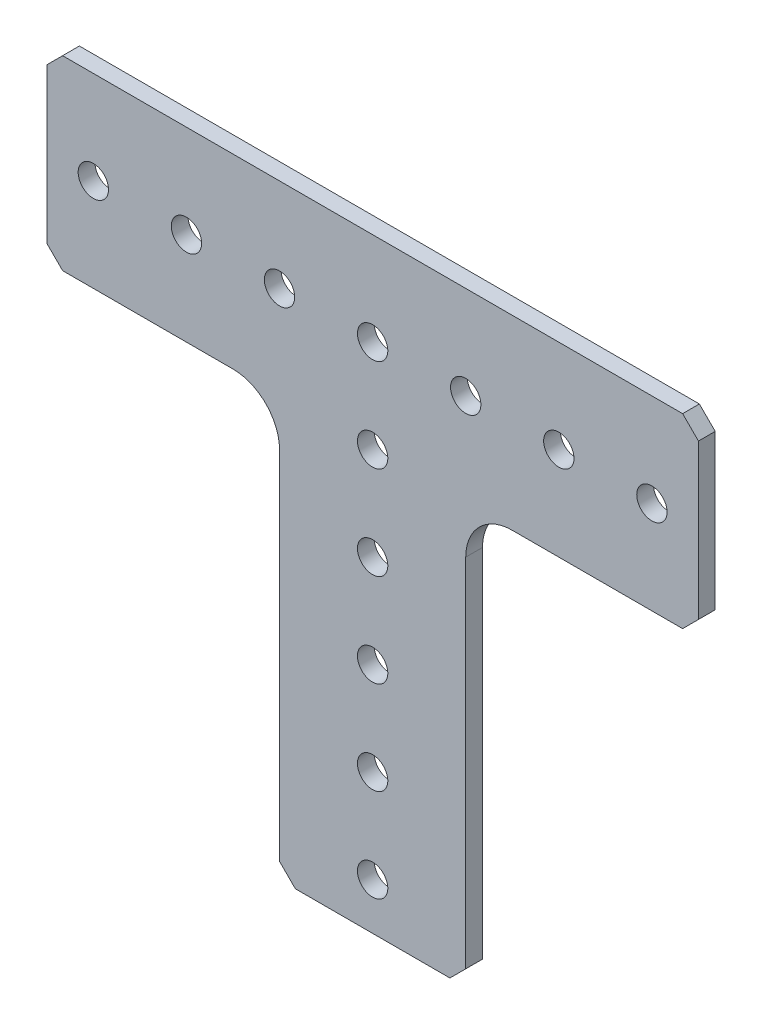
ISO-10303-21;
HEADER;
FILE_DESCRIPTION(('STEP AP214'),'2;1');
FILE_NAME('part.step','',(''),(''),'','','');
FILE_SCHEMA(('AUTOMOTIVE_DESIGN { 1 0 10303 214 1 1 1 1 }'));
ENDSEC;
DATA;
#1=APPLICATION_CONTEXT('core data for automotive mechanical design processes');
#2=APPLICATION_PROTOCOL_DEFINITION('international standard','automotive_design',2000,#1);
#3=PRODUCT_CONTEXT('',#1,'mechanical');
#4=PRODUCT('Part','Part','',(#3));
#5=PRODUCT_RELATED_PRODUCT_CATEGORY('part','',(#4));
#6=PRODUCT_DEFINITION_FORMATION('','',#4);
#7=PRODUCT_DEFINITION_CONTEXT('part definition',#1,'design');
#8=PRODUCT_DEFINITION('design','',#6,#7);
#9=PRODUCT_DEFINITION_SHAPE('','',#8);
#10=(LENGTH_UNIT() NAMED_UNIT(*) SI_UNIT(.MILLI.,.METRE.));
#11=(NAMED_UNIT(*) PLANE_ANGLE_UNIT() SI_UNIT($,.RADIAN.));
#12=(NAMED_UNIT(*) SI_UNIT($,.STERADIAN.) SOLID_ANGLE_UNIT());
#13=UNCERTAINTY_MEASURE_WITH_UNIT(LENGTH_MEASURE(1.E-05),#10,'distance_accuracy_value','');
#14=(GEOMETRIC_REPRESENTATION_CONTEXT(3) GLOBAL_UNCERTAINTY_ASSIGNED_CONTEXT((#13)) GLOBAL_UNIT_ASSIGNED_CONTEXT((#10,
#11,#12)) REPRESENTATION_CONTEXT('',''));
#15=CARTESIAN_POINT('',(0.,0.,0.));
#16=DIRECTION('',(0.,0.,1.));
#17=DIRECTION('',(1.,0.,0.));
#18=AXIS2_PLACEMENT_3D('',#15,#16,#17);
#19=CARTESIAN_POINT('',(10.541,-57.15,0.));
#20=DIRECTION('',(0.707106781186548,-0.707106781186547,0.));
#21=DIRECTION('',(0.707106781186547,0.707106781186548,0.));
#22=AXIS2_PLACEMENT_3D('',#19,#20,#21);
#23=PLANE('',#22);
#24=DIRECTION('',(0.707106781186547,0.707106781186548,0.));
#25=VECTOR('',#24,1.);
#26=CARTESIAN_POINT('',(10.541,-57.15,2.286));
#27=LINE('',#26,#25);
#28=CARTESIAN_POINT('',(10.541,-57.15,2.286));
#29=VERTEX_POINT('',#28);
#30=CARTESIAN_POINT('',(12.7,-54.991,2.286));
#31=VERTEX_POINT('',#30);
#32=EDGE_CURVE('E203',#29,#31,#27,.T.);
#33=ORIENTED_EDGE('',*,*,#32,.F.);
#34=DIRECTION('',(0.,0.,1.));
#35=VECTOR('',#34,1.);
#36=CARTESIAN_POINT('',(10.541,-57.15,0.));
#37=LINE('',#36,#35);
#38=CARTESIAN_POINT('',(10.541,-57.15,0.));
#39=VERTEX_POINT('',#38);
#40=EDGE_CURVE('E11',#39,#29,#37,.T.);
#41=ORIENTED_EDGE('',*,*,#40,.F.);
#42=DIRECTION('',(0.707106781186547,0.707106781186548,0.));
#43=VECTOR('',#42,1.);
#44=CARTESIAN_POINT('',(10.541,-57.15,0.));
#45=LINE('',#44,#43);
#46=CARTESIAN_POINT('',(12.7,-54.991,0.));
#47=VERTEX_POINT('',#46);
#48=EDGE_CURVE('E258',#39,#47,#45,.T.);
#49=ORIENTED_EDGE('',*,*,#48,.T.);
#50=DIRECTION('',(0.,0.,1.));
#51=VECTOR('',#50,1.);
#52=CARTESIAN_POINT('',(12.7,-54.991,0.));
#53=LINE('',#52,#51);
#54=EDGE_CURVE('E44',#47,#31,#53,.T.);
#55=ORIENTED_EDGE('',*,*,#54,.T.);
#56=EDGE_LOOP('',(#33,#41,#49,#55));
#57=FACE_BOUND('',#56,.T.);
#58=ADVANCED_FACE('F41',(#57),#23,.T.);
#59=CARTESIAN_POINT('',(-10.541,-57.15,0.));
#60=DIRECTION('',(0.,-1.,0.));
#61=DIRECTION('',(0.,0.,-1.));
#62=AXIS2_PLACEMENT_3D('',#59,#60,#61);
#63=PLANE('',#62);
#64=DIRECTION('',(1.,0.,0.));
#65=VECTOR('',#64,1.);
#66=CARTESIAN_POINT('',(-10.541,-57.15,2.286));
#67=LINE('',#66,#65);
#68=CARTESIAN_POINT('',(-10.541,-57.15,2.286));
#69=VERTEX_POINT('',#68);
#70=EDGE_CURVE('E255',#69,#29,#67,.T.);
#71=ORIENTED_EDGE('',*,*,#70,.F.);
#72=DIRECTION('',(0.,0.,1.));
#73=VECTOR('',#72,1.);
#74=CARTESIAN_POINT('',(-10.541,-57.15,0.));
#75=LINE('',#74,#73);
#76=CARTESIAN_POINT('',(-10.541,-57.15,0.));
#77=VERTEX_POINT('',#76);
#78=EDGE_CURVE('E51',#77,#69,#75,.T.);
#79=ORIENTED_EDGE('',*,*,#78,.F.);
#80=DIRECTION('',(1.,0.,0.));
#81=VECTOR('',#80,1.);
#82=CARTESIAN_POINT('',(-10.541,-57.15,0.));
#83=LINE('',#82,#81);
#84=EDGE_CURVE('E191',#77,#39,#83,.T.);
#85=ORIENTED_EDGE('',*,*,#84,.T.);
#86=ORIENTED_EDGE('',*,*,#40,.T.);
#87=EDGE_LOOP('',(#71,#79,#85,#86));
#88=FACE_BOUND('',#87,.T.);
#89=ADVANCED_FACE('F292',(#88),#63,.T.);
#90=CARTESIAN_POINT('',(-12.7,-54.991,0.));
#91=DIRECTION('',(-0.707106781186548,-0.707106781186547,0.));
#92=DIRECTION('',(0.707106781186547,-0.707106781186548,0.));
#93=AXIS2_PLACEMENT_3D('',#90,#91,#92);
#94=PLANE('',#93);
#95=DIRECTION('',(0.707106781186547,-0.707106781186548,0.));
#96=VECTOR('',#95,1.);
#97=CARTESIAN_POINT('',(-12.7,-54.991,2.286));
#98=LINE('',#97,#96);
#99=CARTESIAN_POINT('',(-12.7,-54.991,2.286));
#100=VERTEX_POINT('',#99);
#101=EDGE_CURVE('E178',#100,#69,#98,.T.);
#102=ORIENTED_EDGE('',*,*,#101,.F.);
#103=DIRECTION('',(0.,0.,1.));
#104=VECTOR('',#103,1.);
#105=CARTESIAN_POINT('',(-12.7,-54.991,0.));
#106=LINE('',#105,#104);
#107=CARTESIAN_POINT('',(-12.7,-54.991,0.));
#108=VERTEX_POINT('',#107);
#109=EDGE_CURVE('E173',#108,#100,#106,.T.);
#110=ORIENTED_EDGE('',*,*,#109,.F.);
#111=DIRECTION('',(0.707106781186547,-0.707106781186548,0.));
#112=VECTOR('',#111,1.);
#113=CARTESIAN_POINT('',(-12.7,-54.991,0.));
#114=LINE('',#113,#112);
#115=EDGE_CURVE('E176',#108,#77,#114,.T.);
#116=ORIENTED_EDGE('',*,*,#115,.T.);
#117=ORIENTED_EDGE('',*,*,#78,.T.);
#118=EDGE_LOOP('',(#102,#110,#116,#117));
#119=FACE_BOUND('',#118,.T.);
#120=ADVANCED_FACE('F175',(#119),#94,.T.);
#121=CARTESIAN_POINT('',(-12.7,-6.34999999999998,0.));
#122=DIRECTION('',(-1.,0.,0.));
#123=DIRECTION('',(0.,-1.,0.));
#124=AXIS2_PLACEMENT_3D('',#121,#122,#123);
#125=PLANE('',#124);
#126=DIRECTION('',(0.,-1.,0.));
#127=VECTOR('',#126,1.);
#128=CARTESIAN_POINT('',(-12.7,-6.34999999999998,2.286));
#129=LINE('',#128,#127);
#130=CARTESIAN_POINT('',(-12.7,-6.34999999999999,2.286));
#131=VERTEX_POINT('',#130);
#132=EDGE_CURVE('E252',#131,#100,#129,.T.);
#133=ORIENTED_EDGE('',*,*,#132,.F.);
#134=DIRECTION('',(0.,0.,1.));
#135=VECTOR('',#134,1.);
#136=CARTESIAN_POINT('',(-12.7,-6.34999999999999,0.));
#137=LINE('',#136,#135);
#138=CARTESIAN_POINT('',(-12.7,-6.34999999999999,0.));
#139=VERTEX_POINT('',#138);
#140=EDGE_CURVE('E183',#139,#131,#137,.T.);
#141=ORIENTED_EDGE('',*,*,#140,.F.);
#142=DIRECTION('',(0.,-1.,0.));
#143=VECTOR('',#142,1.);
#144=CARTESIAN_POINT('',(-12.7,-6.34999999999998,0.));
#145=LINE('',#144,#143);
#146=EDGE_CURVE('E189',#139,#108,#145,.T.);
#147=ORIENTED_EDGE('',*,*,#146,.T.);
#148=ORIENTED_EDGE('',*,*,#109,.T.);
#149=EDGE_LOOP('',(#133,#141,#147,#148));
#150=FACE_BOUND('',#149,.T.);
#151=ADVANCED_FACE('F193',(#150),#125,.T.);
#152=CARTESIAN_POINT('',(-19.05,-6.34999999999999,0.));
#153=DIRECTION('',(0.,0.,1.));
#154=DIRECTION('',(1.,0.,0.));
#155=AXIS2_PLACEMENT_3D('',#152,#153,#154);
#156=CYLINDRICAL_SURFACE('',#155,6.35);
#157=CARTESIAN_POINT('',(-19.05,-6.34999999999999,2.286));
#158=DIRECTION('',(0.,0.,-1.));
#159=DIRECTION('',(-1.,0.,0.));
#160=AXIS2_PLACEMENT_3D('',#157,#158,#159);
#161=CIRCLE('',#160,6.35);
#162=CARTESIAN_POINT('',(-19.05,0.,2.286));
#163=VERTEX_POINT('',#162);
#164=EDGE_CURVE('E248',#163,#131,#161,.T.);
#165=ORIENTED_EDGE('',*,*,#164,.F.);
#166=DIRECTION('',(0.,0.,1.));
#167=VECTOR('',#166,1.);
#168=CARTESIAN_POINT('',(-19.05,0.,0.));
#169=LINE('',#168,#167);
#170=CARTESIAN_POINT('',(-19.05,0.,0.));
#171=VERTEX_POINT('',#170);
#172=EDGE_CURVE('E262',#171,#163,#169,.T.);
#173=ORIENTED_EDGE('',*,*,#172,.F.);
#174=CARTESIAN_POINT('',(-19.05,-6.34999999999999,0.));
#175=DIRECTION('',(0.,0.,-1.));
#176=DIRECTION('',(-1.,0.,0.));
#177=AXIS2_PLACEMENT_3D('',#174,#175,#176);
#178=CIRCLE('',#177,6.35);
#179=EDGE_CURVE('E194',#171,#139,#178,.T.);
#180=ORIENTED_EDGE('',*,*,#179,.T.);
#181=ORIENTED_EDGE('',*,*,#140,.T.);
#182=EDGE_LOOP('',(#165,#173,#180,#181));
#183=FACE_BOUND('',#182,.T.);
#184=ADVANCED_FACE('F305',(#183),#156,.F.);
#185=CARTESIAN_POINT('',(-42.291,0.,0.));
#186=DIRECTION('',(0.,-1.,0.));
#187=DIRECTION('',(1.,0.,0.));
#188=AXIS2_PLACEMENT_3D('',#185,#186,#187);
#189=PLANE('',#188);
#190=DIRECTION('',(1.,0.,0.));
#191=VECTOR('',#190,1.);
#192=CARTESIAN_POINT('',(-42.291,0.,2.286));
#193=LINE('',#192,#191);
#194=CARTESIAN_POINT('',(-42.291,0.,2.286));
#195=VERTEX_POINT('',#194);
#196=EDGE_CURVE('E244',#195,#163,#193,.T.);
#197=ORIENTED_EDGE('',*,*,#196,.F.);
#198=DIRECTION('',(0.,0.,1.));
#199=VECTOR('',#198,1.);
#200=CARTESIAN_POINT('',(-42.291,0.,0.));
#201=LINE('',#200,#199);
#202=CARTESIAN_POINT('',(-42.291,0.,0.));
#203=VERTEX_POINT('',#202);
#204=EDGE_CURVE('E265',#203,#195,#201,.T.);
#205=ORIENTED_EDGE('',*,*,#204,.F.);
#206=DIRECTION('',(1.,0.,0.));
#207=VECTOR('',#206,1.);
#208=CARTESIAN_POINT('',(-42.291,0.,0.));
#209=LINE('',#208,#207);
#210=EDGE_CURVE('E197',#203,#171,#209,.T.);
#211=ORIENTED_EDGE('',*,*,#210,.T.);
#212=ORIENTED_EDGE('',*,*,#172,.T.);
#213=EDGE_LOOP('',(#197,#205,#211,#212));
#214=FACE_BOUND('',#213,.T.);
#215=ADVANCED_FACE('F308',(#214),#189,.T.);
#216=CARTESIAN_POINT('',(-44.45,2.15899999999999,0.));
#217=DIRECTION('',(-0.707106781186546,-0.707106781186549,0.));
#218=DIRECTION('',(0.707106781186549,-0.707106781186546,0.));
#219=AXIS2_PLACEMENT_3D('',#216,#217,#218);
#220=PLANE('',#219);
#221=DIRECTION('',(0.707106781186549,-0.707106781186547,0.));
#222=VECTOR('',#221,1.);
#223=CARTESIAN_POINT('',(-44.45,2.15899999999999,2.286));
#224=LINE('',#223,#222);
#225=CARTESIAN_POINT('',(-44.45,2.15899999999999,2.286));
#226=VERTEX_POINT('',#225);
#227=EDGE_CURVE('E241',#226,#195,#224,.T.);
#228=ORIENTED_EDGE('',*,*,#227,.F.);
#229=DIRECTION('',(0.,0.,1.));
#230=VECTOR('',#229,1.);
#231=CARTESIAN_POINT('',(-44.45,2.15899999999999,0.));
#232=LINE('',#231,#230);
#233=CARTESIAN_POINT('',(-44.45,2.15899999999999,0.));
#234=VERTEX_POINT('',#233);
#235=EDGE_CURVE('E267',#234,#226,#232,.T.);
#236=ORIENTED_EDGE('',*,*,#235,.F.);
#237=DIRECTION('',(0.707106781186549,-0.707106781186547,0.));
#238=VECTOR('',#237,1.);
#239=CARTESIAN_POINT('',(-44.45,2.15899999999999,0.));
#240=LINE('',#239,#238);
#241=EDGE_CURVE('E522',#234,#203,#240,.T.);
#242=ORIENTED_EDGE('',*,*,#241,.T.);
#243=ORIENTED_EDGE('',*,*,#204,.T.);
#244=EDGE_LOOP('',(#228,#236,#242,#243));
#245=FACE_BOUND('',#244,.T.);
#246=ADVANCED_FACE('F312',(#245),#220,.T.);
#247=CARTESIAN_POINT('',(-44.45,23.241,0.));
#248=DIRECTION('',(-1.,0.,0.));
#249=DIRECTION('',(0.,-1.,0.));
#250=AXIS2_PLACEMENT_3D('',#247,#248,#249);
#251=PLANE('',#250);
#252=DIRECTION('',(0.,-1.,0.));
#253=VECTOR('',#252,1.);
#254=CARTESIAN_POINT('',(-44.45,23.241,2.286));
#255=LINE('',#254,#253);
#256=CARTESIAN_POINT('',(-44.45,23.241,2.286));
#257=VERTEX_POINT('',#256);
#258=EDGE_CURVE('E238',#257,#226,#255,.T.);
#259=ORIENTED_EDGE('',*,*,#258,.F.);
#260=DIRECTION('',(0.,0.,1.));
#261=VECTOR('',#260,1.);
#262=CARTESIAN_POINT('',(-44.45,23.241,0.));
#263=LINE('',#262,#261);
#264=CARTESIAN_POINT('',(-44.45,23.241,0.));
#265=VERTEX_POINT('',#264);
#266=EDGE_CURVE('E269',#265,#257,#263,.T.);
#267=ORIENTED_EDGE('',*,*,#266,.F.);
#268=DIRECTION('',(0.,-1.,0.));
#269=VECTOR('',#268,1.);
#270=CARTESIAN_POINT('',(-44.45,23.241,0.));
#271=LINE('',#270,#269);
#272=EDGE_CURVE('E519',#265,#234,#271,.T.);
#273=ORIENTED_EDGE('',*,*,#272,.T.);
#274=ORIENTED_EDGE('',*,*,#235,.T.);
#275=EDGE_LOOP('',(#259,#267,#273,#274));
#276=FACE_BOUND('',#275,.T.);
#277=ADVANCED_FACE('F316',(#276),#251,.T.);
#278=CARTESIAN_POINT('',(-42.291,25.4,0.));
#279=DIRECTION('',(-0.707106781186546,0.707106781186549,0.));
#280=DIRECTION('',(-0.707106781186549,-0.707106781186546,0.));
#281=AXIS2_PLACEMENT_3D('',#278,#279,#280);
#282=PLANE('',#281);
#283=DIRECTION('',(-0.707106781186549,-0.707106781186546,0.));
#284=VECTOR('',#283,1.);
#285=CARTESIAN_POINT('',(-42.291,25.4,2.286));
#286=LINE('',#285,#284);
#287=CARTESIAN_POINT('',(-42.291,25.4,2.286));
#288=VERTEX_POINT('',#287);
#289=EDGE_CURVE('E235',#288,#257,#286,.T.);
#290=ORIENTED_EDGE('',*,*,#289,.F.);
#291=DIRECTION('',(0.,0.,1.));
#292=VECTOR('',#291,1.);
#293=CARTESIAN_POINT('',(-42.291,25.4,0.));
#294=LINE('',#293,#292);
#295=CARTESIAN_POINT('',(-42.291,25.4,0.));
#296=VERTEX_POINT('',#295);
#297=EDGE_CURVE('E271',#296,#288,#294,.T.);
#298=ORIENTED_EDGE('',*,*,#297,.F.);
#299=DIRECTION('',(-0.707106781186549,-0.707106781186546,0.));
#300=VECTOR('',#299,1.);
#301=CARTESIAN_POINT('',(-42.291,25.4,0.));
#302=LINE('',#301,#300);
#303=EDGE_CURVE('E516',#296,#265,#302,.T.);
#304=ORIENTED_EDGE('',*,*,#303,.T.);
#305=ORIENTED_EDGE('',*,*,#266,.T.);
#306=EDGE_LOOP('',(#290,#298,#304,#305));
#307=FACE_BOUND('',#306,.T.);
#308=ADVANCED_FACE('F320',(#307),#282,.T.);
#309=CARTESIAN_POINT('',(42.291,25.4,0.));
#310=DIRECTION('',(0.,1.,0.));
#311=DIRECTION('',(-1.,0.,0.));
#312=AXIS2_PLACEMENT_3D('',#309,#310,#311);
#313=PLANE('',#312);
#314=DIRECTION('',(-1.,0.,0.));
#315=VECTOR('',#314,1.);
#316=CARTESIAN_POINT('',(42.291,25.4,2.286));
#317=LINE('',#316,#315);
#318=CARTESIAN_POINT('',(42.291,25.4,2.286));
#319=VERTEX_POINT('',#318);
#320=EDGE_CURVE('E231',#319,#288,#317,.T.);
#321=ORIENTED_EDGE('',*,*,#320,.F.);
#322=DIRECTION('',(0.,0.,1.));
#323=VECTOR('',#322,1.);
#324=CARTESIAN_POINT('',(42.291,25.4,0.));
#325=LINE('',#324,#323);
#326=CARTESIAN_POINT('',(42.291,25.4,0.));
#327=VERTEX_POINT('',#326);
#328=EDGE_CURVE('E273',#327,#319,#325,.T.);
#329=ORIENTED_EDGE('',*,*,#328,.F.);
#330=DIRECTION('',(-1.,0.,0.));
#331=VECTOR('',#330,1.);
#332=CARTESIAN_POINT('',(42.291,25.4,0.));
#333=LINE('',#332,#331);
#334=EDGE_CURVE('E512',#327,#296,#333,.T.);
#335=ORIENTED_EDGE('',*,*,#334,.T.);
#336=ORIENTED_EDGE('',*,*,#297,.T.);
#337=EDGE_LOOP('',(#321,#329,#335,#336));
#338=FACE_BOUND('',#337,.T.);
#339=ADVANCED_FACE('F324',(#338),#313,.T.);
#340=CARTESIAN_POINT('',(44.45,23.241,0.));
#341=DIRECTION('',(0.707106781186543,0.707106781186552,0.));
#342=DIRECTION('',(-0.707106781186552,0.707106781186543,0.));
#343=AXIS2_PLACEMENT_3D('',#340,#341,#342);
#344=PLANE('',#343);
#345=DIRECTION('',(-0.707106781186552,0.707106781186543,0.));
#346=VECTOR('',#345,1.);
#347=CARTESIAN_POINT('',(44.45,23.241,2.286));
#348=LINE('',#347,#346);
#349=CARTESIAN_POINT('',(44.45,23.241,2.286));
#350=VERTEX_POINT('',#349);
#351=EDGE_CURVE('E227',#350,#319,#348,.T.);
#352=ORIENTED_EDGE('',*,*,#351,.F.);
#353=DIRECTION('',(0.,0.,1.));
#354=VECTOR('',#353,1.);
#355=CARTESIAN_POINT('',(44.45,23.241,0.));
#356=LINE('',#355,#354);
#357=CARTESIAN_POINT('',(44.45,23.241,0.));
#358=VERTEX_POINT('',#357);
#359=EDGE_CURVE('E276',#358,#350,#356,.T.);
#360=ORIENTED_EDGE('',*,*,#359,.F.);
#361=DIRECTION('',(-0.707106781186552,0.707106781186543,0.));
#362=VECTOR('',#361,1.);
#363=CARTESIAN_POINT('',(44.45,23.241,0.));
#364=LINE('',#363,#362);
#365=EDGE_CURVE('E508',#358,#327,#364,.T.);
#366=ORIENTED_EDGE('',*,*,#365,.T.);
#367=ORIENTED_EDGE('',*,*,#328,.T.);
#368=EDGE_LOOP('',(#352,#360,#366,#367));
#369=FACE_BOUND('',#368,.T.);
#370=ADVANCED_FACE('F328',(#369),#344,.T.);
#371=CARTESIAN_POINT('',(44.45,2.15900000000002,0.));
#372=DIRECTION('',(1.,0.,0.));
#373=DIRECTION('',(0.,1.,0.));
#374=AXIS2_PLACEMENT_3D('',#371,#372,#373);
#375=PLANE('',#374);
#376=DIRECTION('',(0.,1.,0.));
#377=VECTOR('',#376,1.);
#378=CARTESIAN_POINT('',(44.45,2.15900000000002,2.286));
#379=LINE('',#378,#377);
#380=CARTESIAN_POINT('',(44.45,2.15900000000002,2.286));
#381=VERTEX_POINT('',#380);
#382=EDGE_CURVE('E223',#381,#350,#379,.T.);
#383=ORIENTED_EDGE('',*,*,#382,.F.);
#384=DIRECTION('',(0.,0.,1.));
#385=VECTOR('',#384,1.);
#386=CARTESIAN_POINT('',(44.45,2.15900000000002,0.));
#387=LINE('',#386,#385);
#388=CARTESIAN_POINT('',(44.45,2.15900000000002,0.));
#389=VERTEX_POINT('',#388);
#390=EDGE_CURVE('E279',#389,#381,#387,.T.);
#391=ORIENTED_EDGE('',*,*,#390,.F.);
#392=DIRECTION('',(0.,1.,0.));
#393=VECTOR('',#392,1.);
#394=CARTESIAN_POINT('',(44.45,2.15900000000002,0.));
#395=LINE('',#394,#393);
#396=EDGE_CURVE('E504',#389,#358,#395,.T.);
#397=ORIENTED_EDGE('',*,*,#396,.T.);
#398=ORIENTED_EDGE('',*,*,#359,.T.);
#399=EDGE_LOOP('',(#383,#391,#397,#398));
#400=FACE_BOUND('',#399,.T.);
#401=ADVANCED_FACE('F332',(#400),#375,.T.);
#402=CARTESIAN_POINT('',(42.291,0.,0.));
#403=DIRECTION('',(0.707106781186548,-0.707106781186547,0.));
#404=DIRECTION('',(0.707106781186547,0.707106781186548,0.));
#405=AXIS2_PLACEMENT_3D('',#402,#403,#404);
#406=PLANE('',#405);
#407=DIRECTION('',(0.707106781186547,0.707106781186548,0.));
#408=VECTOR('',#407,1.);
#409=CARTESIAN_POINT('',(42.291,0.,2.286));
#410=LINE('',#409,#408);
#411=CARTESIAN_POINT('',(42.291,0.,2.286));
#412=VERTEX_POINT('',#411);
#413=EDGE_CURVE('E219',#412,#381,#410,.T.);
#414=ORIENTED_EDGE('',*,*,#413,.F.);
#415=DIRECTION('',(0.,0.,1.));
#416=VECTOR('',#415,1.);
#417=CARTESIAN_POINT('',(42.291,0.,0.));
#418=LINE('',#417,#416);
#419=CARTESIAN_POINT('',(42.291,0.,0.));
#420=VERTEX_POINT('',#419);
#421=EDGE_CURVE('E282',#420,#412,#418,.T.);
#422=ORIENTED_EDGE('',*,*,#421,.F.);
#423=DIRECTION('',(0.707106781186547,0.707106781186548,0.));
#424=VECTOR('',#423,1.);
#425=CARTESIAN_POINT('',(42.291,0.,0.));
#426=LINE('',#425,#424);
#427=EDGE_CURVE('E500',#420,#389,#426,.T.);
#428=ORIENTED_EDGE('',*,*,#427,.T.);
#429=ORIENTED_EDGE('',*,*,#390,.T.);
#430=EDGE_LOOP('',(#414,#422,#428,#429));
#431=FACE_BOUND('',#430,.T.);
#432=ADVANCED_FACE('F336',(#431),#406,.T.);
#433=CARTESIAN_POINT('',(19.05,0.,0.));
#434=DIRECTION('',(0.,-1.,0.));
#435=DIRECTION('',(1.,0.,0.));
#436=AXIS2_PLACEMENT_3D('',#433,#434,#435);
#437=PLANE('',#436);
#438=DIRECTION('',(1.,0.,0.));
#439=VECTOR('',#438,1.);
#440=CARTESIAN_POINT('',(19.05,0.,2.286));
#441=LINE('',#440,#439);
#442=CARTESIAN_POINT('',(19.05,0.,2.286));
#443=VERTEX_POINT('',#442);
#444=EDGE_CURVE('E215',#443,#412,#441,.T.);
#445=ORIENTED_EDGE('',*,*,#444,.F.);
#446=DIRECTION('',(0.,0.,1.));
#447=VECTOR('',#446,1.);
#448=CARTESIAN_POINT('',(19.05,0.,0.));
#449=LINE('',#448,#447);
#450=CARTESIAN_POINT('',(19.05,0.,0.));
#451=VERTEX_POINT('',#450);
#452=EDGE_CURVE('E285',#451,#443,#449,.T.);
#453=ORIENTED_EDGE('',*,*,#452,.F.);
#454=DIRECTION('',(1.,0.,0.));
#455=VECTOR('',#454,1.);
#456=CARTESIAN_POINT('',(19.05,0.,0.));
#457=LINE('',#456,#455);
#458=EDGE_CURVE('E496',#451,#420,#457,.T.);
#459=ORIENTED_EDGE('',*,*,#458,.T.);
#460=ORIENTED_EDGE('',*,*,#421,.T.);
#461=EDGE_LOOP('',(#445,#453,#459,#460));
#462=FACE_BOUND('',#461,.T.);
#463=ADVANCED_FACE('F340',(#462),#437,.T.);
#464=CARTESIAN_POINT('',(19.05,-6.34999999999998,0.));
#465=DIRECTION('',(0.,0.,1.));
#466=DIRECTION('',(1.,0.,0.));
#467=AXIS2_PLACEMENT_3D('',#464,#465,#466);
#468=CYLINDRICAL_SURFACE('',#467,6.35);
#469=CARTESIAN_POINT('',(19.05,-6.34999999999998,2.286));
#470=DIRECTION('',(0.,0.,-1.));
#471=DIRECTION('',(-1.,0.,0.));
#472=AXIS2_PLACEMENT_3D('',#469,#470,#471);
#473=CIRCLE('',#472,6.35);
#474=CARTESIAN_POINT('',(12.7,-6.34999999999998,2.286));
#475=VERTEX_POINT('',#474);
#476=EDGE_CURVE('E212',#475,#443,#473,.T.);
#477=ORIENTED_EDGE('',*,*,#476,.F.);
#478=DIRECTION('',(0.,0.,1.));
#479=VECTOR('',#478,1.);
#480=CARTESIAN_POINT('',(12.7,-6.34999999999998,0.));
#481=LINE('',#480,#479);
#482=CARTESIAN_POINT('',(12.7,-6.34999999999998,0.));
#483=VERTEX_POINT('',#482);
#484=EDGE_CURVE('E286',#483,#475,#481,.T.);
#485=ORIENTED_EDGE('',*,*,#484,.F.);
#486=CARTESIAN_POINT('',(19.05,-6.34999999999998,0.));
#487=DIRECTION('',(0.,0.,-1.));
#488=DIRECTION('',(-1.,0.,0.));
#489=AXIS2_PLACEMENT_3D('',#486,#487,#488);
#490=CIRCLE('',#489,6.35);
#491=EDGE_CURVE('E493',#483,#451,#490,.T.);
#492=ORIENTED_EDGE('',*,*,#491,.T.);
#493=ORIENTED_EDGE('',*,*,#452,.T.);
#494=EDGE_LOOP('',(#477,#485,#492,#493));
#495=FACE_BOUND('',#494,.T.);
#496=ADVANCED_FACE('F344',(#495),#468,.F.);
#497=CARTESIAN_POINT('',(12.7,-54.991,0.));
#498=DIRECTION('',(1.,0.,0.));
#499=DIRECTION('',(0.,1.,0.));
#500=AXIS2_PLACEMENT_3D('',#497,#498,#499);
#501=PLANE('',#500);
#502=DIRECTION('',(0.,1.,0.));
#503=VECTOR('',#502,1.);
#504=CARTESIAN_POINT('',(12.7,-54.991,2.286));
#505=LINE('',#504,#503);
#506=EDGE_CURVE('E207',#31,#475,#505,.T.);
#507=ORIENTED_EDGE('',*,*,#506,.F.);
#508=ORIENTED_EDGE('',*,*,#54,.F.);
#509=DIRECTION('',(0.,1.,0.));
#510=VECTOR('',#509,1.);
#511=CARTESIAN_POINT('',(12.7,-54.991,0.));
#512=LINE('',#511,#510);
#513=EDGE_CURVE('E491',#47,#483,#512,.T.);
#514=ORIENTED_EDGE('',*,*,#513,.T.);
#515=ORIENTED_EDGE('',*,*,#484,.T.);
#516=EDGE_LOOP('',(#507,#508,#514,#515));
#517=FACE_BOUND('',#516,.T.);
#518=ADVANCED_FACE('F289',(#517),#501,.T.);
#519=CARTESIAN_POINT('',(19.05,-6.34999999999998,0.));
#520=DIRECTION('',(0.,0.,-1.));
#521=DIRECTION('',(-1.,0.,0.));
#522=AXIS2_PLACEMENT_3D('',#519,#520,#521);
#523=PLANE('',#522);
#524=CARTESIAN_POINT('',(0.,-50.8,0.));
#525=DIRECTION('',(0.,0.,1.));
#526=DIRECTION('',(-1.,0.,0.));
#527=AXIS2_PLACEMENT_3D('',#524,#525,#526);
#528=CIRCLE('',#527,2.0701);
#529=CARTESIAN_POINT('',(-2.07009999999999,-50.8,0.));
#530=VERTEX_POINT('',#529);
#531=EDGE_CURVE('E411',#530,#530,#528,.T.);
#532=ORIENTED_EDGE('',*,*,#531,.T.);
#533=EDGE_LOOP('',(#532));
#534=FACE_BOUND('',#533,.T.);
#535=CARTESIAN_POINT('',(0.,-25.4,0.));
#536=DIRECTION('',(0.,0.,1.));
#537=DIRECTION('',(-1.,0.,0.));
#538=AXIS2_PLACEMENT_3D('',#535,#536,#537);
#539=CIRCLE('',#538,2.0701);
#540=CARTESIAN_POINT('',(-2.0701,-25.4,0.));
#541=VERTEX_POINT('',#540);
#542=EDGE_CURVE('E421',#541,#541,#539,.T.);
#543=ORIENTED_EDGE('',*,*,#542,.T.);
#544=EDGE_LOOP('',(#543));
#545=FACE_BOUND('',#544,.T.);
#546=CARTESIAN_POINT('',(0.,0.,0.));
#547=DIRECTION('',(0.,0.,1.));
#548=DIRECTION('',(-1.,0.,0.));
#549=AXIS2_PLACEMENT_3D('',#546,#547,#548);
#550=CIRCLE('',#549,2.0701);
#551=CARTESIAN_POINT('',(-2.0701,0.,0.));
#552=VERTEX_POINT('',#551);
#553=EDGE_CURVE('E427',#552,#552,#550,.T.);
#554=ORIENTED_EDGE('',*,*,#553,.T.);
#555=EDGE_LOOP('',(#554));
#556=FACE_BOUND('',#555,.T.);
#557=CARTESIAN_POINT('',(25.4,12.7,0.));
#558=DIRECTION('',(0.,0.,1.));
#559=DIRECTION('',(-1.,0.,0.));
#560=AXIS2_PLACEMENT_3D('',#557,#558,#559);
#561=CIRCLE('',#560,2.0701);
#562=CARTESIAN_POINT('',(23.3299,12.7,0.));
#563=VERTEX_POINT('',#562);
#564=EDGE_CURVE('E433',#563,#563,#561,.T.);
#565=ORIENTED_EDGE('',*,*,#564,.T.);
#566=EDGE_LOOP('',(#565));
#567=FACE_BOUND('',#566,.T.);
#568=CARTESIAN_POINT('',(0.,12.7,0.));
#569=DIRECTION('',(0.,0.,1.));
#570=DIRECTION('',(-1.,0.,0.));
#571=AXIS2_PLACEMENT_3D('',#568,#569,#570);
#572=CIRCLE('',#571,2.0701);
#573=CARTESIAN_POINT('',(-2.0701,12.7,0.));
#574=VERTEX_POINT('',#573);
#575=EDGE_CURVE('E439',#574,#574,#572,.T.);
#576=ORIENTED_EDGE('',*,*,#575,.T.);
#577=EDGE_LOOP('',(#576));
#578=FACE_BOUND('',#577,.T.);
#579=CARTESIAN_POINT('',(-25.4,12.7,0.));
#580=DIRECTION('',(0.,0.,1.));
#581=DIRECTION('',(-1.,0.,0.));
#582=AXIS2_PLACEMENT_3D('',#579,#580,#581);
#583=CIRCLE('',#582,2.0701);
#584=CARTESIAN_POINT('',(-27.4701,12.7,0.));
#585=VERTEX_POINT('',#584);
#586=EDGE_CURVE('E447',#585,#585,#583,.T.);
#587=ORIENTED_EDGE('',*,*,#586,.T.);
#588=EDGE_LOOP('',(#587));
#589=FACE_BOUND('',#588,.T.);
#590=CARTESIAN_POINT('',(-38.1,12.7,0.));
#591=DIRECTION('',(0.,0.,1.));
#592=DIRECTION('',(-1.,0.,0.));
#593=AXIS2_PLACEMENT_3D('',#590,#591,#592);
#594=CIRCLE('',#593,2.0701);
#595=CARTESIAN_POINT('',(-40.1701,12.7,0.));
#596=VERTEX_POINT('',#595);
#597=EDGE_CURVE('E453',#596,#596,#594,.T.);
#598=ORIENTED_EDGE('',*,*,#597,.T.);
#599=EDGE_LOOP('',(#598));
#600=FACE_BOUND('',#599,.T.);
#601=CARTESIAN_POINT('',(-12.7,12.7,0.));
#602=DIRECTION('',(0.,0.,1.));
#603=DIRECTION('',(-1.,0.,0.));
#604=AXIS2_PLACEMENT_3D('',#601,#602,#603);
#605=CIRCLE('',#604,2.0701);
#606=CARTESIAN_POINT('',(-14.7701,12.7,0.));
#607=VERTEX_POINT('',#606);
#608=EDGE_CURVE('E459',#607,#607,#605,.T.);
#609=ORIENTED_EDGE('',*,*,#608,.T.);
#610=EDGE_LOOP('',(#609));
#611=FACE_BOUND('',#610,.T.);
#612=CARTESIAN_POINT('',(12.7,12.7,0.));
#613=DIRECTION('',(0.,0.,1.));
#614=DIRECTION('',(-1.,0.,0.));
#615=AXIS2_PLACEMENT_3D('',#612,#613,#614);
#616=CIRCLE('',#615,2.0701);
#617=CARTESIAN_POINT('',(10.6299,12.7,0.));
#618=VERTEX_POINT('',#617);
#619=EDGE_CURVE('E465',#618,#618,#616,.T.);
#620=ORIENTED_EDGE('',*,*,#619,.T.);
#621=EDGE_LOOP('',(#620));
#622=FACE_BOUND('',#621,.T.);
#623=CARTESIAN_POINT('',(38.1,12.7,0.));
#624=DIRECTION('',(0.,0.,1.));
#625=DIRECTION('',(-1.,0.,0.));
#626=AXIS2_PLACEMENT_3D('',#623,#624,#625);
#627=CIRCLE('',#626,2.0701);
#628=CARTESIAN_POINT('',(36.0299,12.7,0.));
#629=VERTEX_POINT('',#628);
#630=EDGE_CURVE('E471',#629,#629,#627,.T.);
#631=ORIENTED_EDGE('',*,*,#630,.T.);
#632=EDGE_LOOP('',(#631));
#633=FACE_BOUND('',#632,.T.);
#634=CARTESIAN_POINT('',(0.,-12.7,0.));
#635=DIRECTION('',(0.,0.,1.));
#636=DIRECTION('',(-1.,0.,0.));
#637=AXIS2_PLACEMENT_3D('',#634,#635,#636);
#638=CIRCLE('',#637,2.0701);
#639=CARTESIAN_POINT('',(-2.0701,-12.7,0.));
#640=VERTEX_POINT('',#639);
#641=EDGE_CURVE('E479',#640,#640,#638,.T.);
#642=ORIENTED_EDGE('',*,*,#641,.T.);
#643=EDGE_LOOP('',(#642));
#644=FACE_BOUND('',#643,.T.);
#645=CARTESIAN_POINT('',(0.,-38.1,0.));
#646=DIRECTION('',(0.,0.,1.));
#647=DIRECTION('',(-1.,0.,0.));
#648=AXIS2_PLACEMENT_3D('',#645,#646,#647);
#649=CIRCLE('',#648,2.0701);
#650=CARTESIAN_POINT('',(-2.0701,-38.1,0.));
#651=VERTEX_POINT('',#650);
#652=EDGE_CURVE('E208',#651,#651,#649,.T.);
#653=ORIENTED_EDGE('',*,*,#652,.T.);
#654=EDGE_LOOP('',(#653));
#655=FACE_BOUND('',#654,.T.);
#656=ORIENTED_EDGE('',*,*,#48,.F.);
#657=ORIENTED_EDGE('',*,*,#84,.F.);
#658=ORIENTED_EDGE('',*,*,#115,.F.);
#659=ORIENTED_EDGE('',*,*,#146,.F.);
#660=ORIENTED_EDGE('',*,*,#179,.F.);
#661=ORIENTED_EDGE('',*,*,#210,.F.);
#662=ORIENTED_EDGE('',*,*,#241,.F.);
#663=ORIENTED_EDGE('',*,*,#272,.F.);
#664=ORIENTED_EDGE('',*,*,#303,.F.);
#665=ORIENTED_EDGE('',*,*,#334,.F.);
#666=ORIENTED_EDGE('',*,*,#365,.F.);
#667=ORIENTED_EDGE('',*,*,#396,.F.);
#668=ORIENTED_EDGE('',*,*,#427,.F.);
#669=ORIENTED_EDGE('',*,*,#458,.F.);
#670=ORIENTED_EDGE('',*,*,#491,.F.);
#671=ORIENTED_EDGE('',*,*,#513,.F.);
#672=EDGE_LOOP('',(#656,#657,#658,#659,#660,#661,#662,#663,#664,#665,#666,#667,#668,#669,#670,#671));
#673=FACE_BOUND('',#672,.T.);
#674=ADVANCED_FACE('F187',(#534,#545,#556,#567,#578,#589,#600,#611,#622,#633,#644,#655,#673),
#523,.T.);
#675=CARTESIAN_POINT('',(19.05,-6.34999999999998,2.286));
#676=DIRECTION('',(0.,0.,-1.));
#677=DIRECTION('',(-1.,0.,0.));
#678=AXIS2_PLACEMENT_3D('',#675,#676,#677);
#679=PLANE('',#678);
#680=CARTESIAN_POINT('',(0.,-50.8,2.286));
#681=DIRECTION('',(0.,0.,1.));
#682=DIRECTION('',(-1.,0.,0.));
#683=AXIS2_PLACEMENT_3D('',#680,#681,#682);
#684=CIRCLE('',#683,2.0701);
#685=CARTESIAN_POINT('',(-2.07009999999999,-50.8,2.286));
#686=VERTEX_POINT('',#685);
#687=EDGE_CURVE('E414',#686,#686,#684,.T.);
#688=ORIENTED_EDGE('',*,*,#687,.F.);
#689=EDGE_LOOP('',(#688));
#690=FACE_BOUND('',#689,.T.);
#691=CARTESIAN_POINT('',(0.,-25.4,2.286));
#692=DIRECTION('',(0.,0.,1.));
#693=DIRECTION('',(-1.,0.,0.));
#694=AXIS2_PLACEMENT_3D('',#691,#692,#693);
#695=CIRCLE('',#694,2.0701);
#696=CARTESIAN_POINT('',(-2.0701,-25.4,2.286));
#697=VERTEX_POINT('',#696);
#698=EDGE_CURVE('E418',#697,#697,#695,.T.);
#699=ORIENTED_EDGE('',*,*,#698,.F.);
#700=EDGE_LOOP('',(#699));
#701=FACE_BOUND('',#700,.T.);
#702=CARTESIAN_POINT('',(0.,0.,2.286));
#703=DIRECTION('',(0.,0.,1.));
#704=DIRECTION('',(-1.,0.,0.));
#705=AXIS2_PLACEMENT_3D('',#702,#703,#704);
#706=CIRCLE('',#705,2.0701);
#707=CARTESIAN_POINT('',(-2.0701,0.,2.286));
#708=VERTEX_POINT('',#707);
#709=EDGE_CURVE('E424',#708,#708,#706,.T.);
#710=ORIENTED_EDGE('',*,*,#709,.F.);
#711=EDGE_LOOP('',(#710));
#712=FACE_BOUND('',#711,.T.);
#713=CARTESIAN_POINT('',(25.4,12.7,2.286));
#714=DIRECTION('',(0.,0.,1.));
#715=DIRECTION('',(-1.,0.,0.));
#716=AXIS2_PLACEMENT_3D('',#713,#714,#715);
#717=CIRCLE('',#716,2.0701);
#718=CARTESIAN_POINT('',(23.3299,12.7,2.286));
#719=VERTEX_POINT('',#718);
#720=EDGE_CURVE('E430',#719,#719,#717,.T.);
#721=ORIENTED_EDGE('',*,*,#720,.F.);
#722=EDGE_LOOP('',(#721));
#723=FACE_BOUND('',#722,.T.);
#724=CARTESIAN_POINT('',(0.,12.7,2.286));
#725=DIRECTION('',(0.,0.,1.));
#726=DIRECTION('',(-1.,0.,0.));
#727=AXIS2_PLACEMENT_3D('',#724,#725,#726);
#728=CIRCLE('',#727,2.0701);
#729=CARTESIAN_POINT('',(-2.0701,12.7,2.286));
#730=VERTEX_POINT('',#729);
#731=EDGE_CURVE('E436',#730,#730,#728,.T.);
#732=ORIENTED_EDGE('',*,*,#731,.F.);
#733=EDGE_LOOP('',(#732));
#734=FACE_BOUND('',#733,.T.);
#735=CARTESIAN_POINT('',(-25.4,12.7,2.286));
#736=DIRECTION('',(0.,0.,1.));
#737=DIRECTION('',(-1.,0.,0.));
#738=AXIS2_PLACEMENT_3D('',#735,#736,#737);
#739=CIRCLE('',#738,2.0701);
#740=CARTESIAN_POINT('',(-27.4701,12.7,2.286));
#741=VERTEX_POINT('',#740);
#742=EDGE_CURVE('E443',#741,#741,#739,.T.);
#743=ORIENTED_EDGE('',*,*,#742,.F.);
#744=EDGE_LOOP('',(#743));
#745=FACE_BOUND('',#744,.T.);
#746=CARTESIAN_POINT('',(-38.1,12.7,2.286));
#747=DIRECTION('',(0.,0.,1.));
#748=DIRECTION('',(-1.,0.,0.));
#749=AXIS2_PLACEMENT_3D('',#746,#747,#748);
#750=CIRCLE('',#749,2.0701);
#751=CARTESIAN_POINT('',(-40.1701,12.7,2.286));
#752=VERTEX_POINT('',#751);
#753=EDGE_CURVE('E450',#752,#752,#750,.T.);
#754=ORIENTED_EDGE('',*,*,#753,.F.);
#755=EDGE_LOOP('',(#754));
#756=FACE_BOUND('',#755,.T.);
#757=CARTESIAN_POINT('',(-12.7,12.7,2.286));
#758=DIRECTION('',(0.,0.,1.));
#759=DIRECTION('',(-1.,0.,0.));
#760=AXIS2_PLACEMENT_3D('',#757,#758,#759);
#761=CIRCLE('',#760,2.0701);
#762=CARTESIAN_POINT('',(-14.7701,12.7,2.286));
#763=VERTEX_POINT('',#762);
#764=EDGE_CURVE('E456',#763,#763,#761,.T.);
#765=ORIENTED_EDGE('',*,*,#764,.F.);
#766=EDGE_LOOP('',(#765));
#767=FACE_BOUND('',#766,.T.);
#768=CARTESIAN_POINT('',(12.7,12.7,2.286));
#769=DIRECTION('',(0.,0.,1.));
#770=DIRECTION('',(-1.,0.,0.));
#771=AXIS2_PLACEMENT_3D('',#768,#769,#770);
#772=CIRCLE('',#771,2.0701);
#773=CARTESIAN_POINT('',(10.6299,12.7,2.286));
#774=VERTEX_POINT('',#773);
#775=EDGE_CURVE('E462',#774,#774,#772,.T.);
#776=ORIENTED_EDGE('',*,*,#775,.F.);
#777=EDGE_LOOP('',(#776));
#778=FACE_BOUND('',#777,.T.);
#779=CARTESIAN_POINT('',(38.1,12.7,2.286));
#780=DIRECTION('',(0.,0.,1.));
#781=DIRECTION('',(-1.,0.,0.));
#782=AXIS2_PLACEMENT_3D('',#779,#780,#781);
#783=CIRCLE('',#782,2.0701);
#784=CARTESIAN_POINT('',(36.0299,12.7,2.286));
#785=VERTEX_POINT('',#784);
#786=EDGE_CURVE('E468',#785,#785,#783,.T.);
#787=ORIENTED_EDGE('',*,*,#786,.F.);
#788=EDGE_LOOP('',(#787));
#789=FACE_BOUND('',#788,.T.);
#790=CARTESIAN_POINT('',(0.,-12.7,2.286));
#791=DIRECTION('',(0.,0.,1.));
#792=DIRECTION('',(-1.,0.,0.));
#793=AXIS2_PLACEMENT_3D('',#790,#791,#792);
#794=CIRCLE('',#793,2.0701);
#795=CARTESIAN_POINT('',(-2.0701,-12.7,2.286));
#796=VERTEX_POINT('',#795);
#797=EDGE_CURVE('E475',#796,#796,#794,.T.);
#798=ORIENTED_EDGE('',*,*,#797,.F.);
#799=EDGE_LOOP('',(#798));
#800=FACE_BOUND('',#799,.T.);
#801=CARTESIAN_POINT('',(0.,-38.1,2.286));
#802=DIRECTION('',(0.,0.,1.));
#803=DIRECTION('',(-1.,0.,0.));
#804=AXIS2_PLACEMENT_3D('',#801,#802,#803);
#805=CIRCLE('',#804,2.0701);
#806=CARTESIAN_POINT('',(-2.0701,-38.1,2.286));
#807=VERTEX_POINT('',#806);
#808=EDGE_CURVE('E482',#807,#807,#805,.T.);
#809=ORIENTED_EDGE('',*,*,#808,.F.);
#810=EDGE_LOOP('',(#809));
#811=FACE_BOUND('',#810,.T.);
#812=ORIENTED_EDGE('',*,*,#32,.T.);
#813=ORIENTED_EDGE('',*,*,#506,.T.);
#814=ORIENTED_EDGE('',*,*,#476,.T.);
#815=ORIENTED_EDGE('',*,*,#444,.T.);
#816=ORIENTED_EDGE('',*,*,#413,.T.);
#817=ORIENTED_EDGE('',*,*,#382,.T.);
#818=ORIENTED_EDGE('',*,*,#351,.T.);
#819=ORIENTED_EDGE('',*,*,#320,.T.);
#820=ORIENTED_EDGE('',*,*,#289,.T.);
#821=ORIENTED_EDGE('',*,*,#258,.T.);
#822=ORIENTED_EDGE('',*,*,#227,.T.);
#823=ORIENTED_EDGE('',*,*,#196,.T.);
#824=ORIENTED_EDGE('',*,*,#164,.T.);
#825=ORIENTED_EDGE('',*,*,#132,.T.);
#826=ORIENTED_EDGE('',*,*,#101,.T.);
#827=ORIENTED_EDGE('',*,*,#70,.T.);
#828=EDGE_LOOP('',(#812,#813,#814,#815,#816,#817,#818,#819,#820,#821,#822,#823,#824,#825,#826,#827));
#829=FACE_BOUND('',#828,.T.);
#830=ADVANCED_FACE('F291',(#690,#701,#712,#723,#734,#745,#756,#767,#778,#789,#800,#811,#829),
#679,.F.);
#831=CARTESIAN_POINT('',(0.,-38.1,0.));
#832=DIRECTION('',(0.,0.,1.));
#833=DIRECTION('',(1.,0.,0.));
#834=AXIS2_PLACEMENT_3D('',#831,#832,#833);
#835=CYLINDRICAL_SURFACE('',#834,2.0701);
#836=ORIENTED_EDGE('',*,*,#652,.F.);
#837=EDGE_LOOP('',(#836));
#838=FACE_BOUND('',#837,.T.);
#839=ORIENTED_EDGE('',*,*,#808,.T.);
#840=EDGE_LOOP('',(#839));
#841=FACE_BOUND('',#840,.T.);
#842=ADVANCED_FACE('F356',(#838,#841),#835,.F.);
#843=CARTESIAN_POINT('',(0.,-12.7,0.));
#844=DIRECTION('',(0.,0.,1.));
#845=DIRECTION('',(1.,0.,0.));
#846=AXIS2_PLACEMENT_3D('',#843,#844,#845);
#847=CYLINDRICAL_SURFACE('',#846,2.0701);
#848=ORIENTED_EDGE('',*,*,#641,.F.);
#849=EDGE_LOOP('',(#848));
#850=FACE_BOUND('',#849,.T.);
#851=ORIENTED_EDGE('',*,*,#797,.T.);
#852=EDGE_LOOP('',(#851));
#853=FACE_BOUND('',#852,.T.);
#854=ADVANCED_FACE('F363',(#850,#853),#847,.F.);
#855=CARTESIAN_POINT('',(38.1,12.7,0.));
#856=DIRECTION('',(0.,0.,1.));
#857=DIRECTION('',(1.,0.,0.));
#858=AXIS2_PLACEMENT_3D('',#855,#856,#857);
#859=CYLINDRICAL_SURFACE('',#858,2.0701);
#860=ORIENTED_EDGE('',*,*,#630,.F.);
#861=EDGE_LOOP('',(#860));
#862=FACE_BOUND('',#861,.T.);
#863=ORIENTED_EDGE('',*,*,#786,.T.);
#864=EDGE_LOOP('',(#863));
#865=FACE_BOUND('',#864,.T.);
#866=ADVANCED_FACE('F367',(#862,#865),#859,.F.);
#867=CARTESIAN_POINT('',(12.7,12.7,0.));
#868=DIRECTION('',(0.,0.,1.));
#869=DIRECTION('',(1.,0.,0.));
#870=AXIS2_PLACEMENT_3D('',#867,#868,#869);
#871=CYLINDRICAL_SURFACE('',#870,2.0701);
#872=ORIENTED_EDGE('',*,*,#619,.F.);
#873=EDGE_LOOP('',(#872));
#874=FACE_BOUND('',#873,.T.);
#875=ORIENTED_EDGE('',*,*,#775,.T.);
#876=EDGE_LOOP('',(#875));
#877=FACE_BOUND('',#876,.T.);
#878=ADVANCED_FACE('F371',(#874,#877),#871,.F.);
#879=CARTESIAN_POINT('',(-12.7,12.7,0.));
#880=DIRECTION('',(0.,0.,1.));
#881=DIRECTION('',(1.,0.,0.));
#882=AXIS2_PLACEMENT_3D('',#879,#880,#881);
#883=CYLINDRICAL_SURFACE('',#882,2.0701);
#884=ORIENTED_EDGE('',*,*,#608,.F.);
#885=EDGE_LOOP('',(#884));
#886=FACE_BOUND('',#885,.T.);
#887=ORIENTED_EDGE('',*,*,#764,.T.);
#888=EDGE_LOOP('',(#887));
#889=FACE_BOUND('',#888,.T.);
#890=ADVANCED_FACE('F375',(#886,#889),#883,.F.);
#891=CARTESIAN_POINT('',(-38.1,12.7,0.));
#892=DIRECTION('',(0.,0.,1.));
#893=DIRECTION('',(1.,0.,0.));
#894=AXIS2_PLACEMENT_3D('',#891,#892,#893);
#895=CYLINDRICAL_SURFACE('',#894,2.0701);
#896=ORIENTED_EDGE('',*,*,#597,.F.);
#897=EDGE_LOOP('',(#896));
#898=FACE_BOUND('',#897,.T.);
#899=ORIENTED_EDGE('',*,*,#753,.T.);
#900=EDGE_LOOP('',(#899));
#901=FACE_BOUND('',#900,.T.);
#902=ADVANCED_FACE('F379',(#898,#901),#895,.F.);
#903=CARTESIAN_POINT('',(-25.4,12.7,0.));
#904=DIRECTION('',(0.,0.,1.));
#905=DIRECTION('',(1.,0.,0.));
#906=AXIS2_PLACEMENT_3D('',#903,#904,#905);
#907=CYLINDRICAL_SURFACE('',#906,2.0701);
#908=ORIENTED_EDGE('',*,*,#586,.F.);
#909=EDGE_LOOP('',(#908));
#910=FACE_BOUND('',#909,.T.);
#911=ORIENTED_EDGE('',*,*,#742,.T.);
#912=EDGE_LOOP('',(#911));
#913=FACE_BOUND('',#912,.T.);
#914=ADVANCED_FACE('F383',(#910,#913),#907,.F.);
#915=CARTESIAN_POINT('',(0.,12.7,0.));
#916=DIRECTION('',(0.,0.,1.));
#917=DIRECTION('',(1.,0.,0.));
#918=AXIS2_PLACEMENT_3D('',#915,#916,#917);
#919=CYLINDRICAL_SURFACE('',#918,2.0701);
#920=ORIENTED_EDGE('',*,*,#575,.F.);
#921=EDGE_LOOP('',(#920));
#922=FACE_BOUND('',#921,.T.);
#923=ORIENTED_EDGE('',*,*,#731,.T.);
#924=EDGE_LOOP('',(#923));
#925=FACE_BOUND('',#924,.T.);
#926=ADVANCED_FACE('F387',(#922,#925),#919,.F.);
#927=CARTESIAN_POINT('',(25.4,12.7,0.));
#928=DIRECTION('',(0.,0.,1.));
#929=DIRECTION('',(1.,0.,0.));
#930=AXIS2_PLACEMENT_3D('',#927,#928,#929);
#931=CYLINDRICAL_SURFACE('',#930,2.0701);
#932=ORIENTED_EDGE('',*,*,#564,.F.);
#933=EDGE_LOOP('',(#932));
#934=FACE_BOUND('',#933,.T.);
#935=ORIENTED_EDGE('',*,*,#720,.T.);
#936=EDGE_LOOP('',(#935));
#937=FACE_BOUND('',#936,.T.);
#938=ADVANCED_FACE('F391',(#934,#937),#931,.F.);
#939=CARTESIAN_POINT('',(0.,0.,0.));
#940=DIRECTION('',(0.,0.,1.));
#941=DIRECTION('',(1.,0.,0.));
#942=AXIS2_PLACEMENT_3D('',#939,#940,#941);
#943=CYLINDRICAL_SURFACE('',#942,2.0701);
#944=ORIENTED_EDGE('',*,*,#553,.F.);
#945=EDGE_LOOP('',(#944));
#946=FACE_BOUND('',#945,.T.);
#947=ORIENTED_EDGE('',*,*,#709,.T.);
#948=EDGE_LOOP('',(#947));
#949=FACE_BOUND('',#948,.T.);
#950=ADVANCED_FACE('F395',(#946,#949),#943,.F.);
#951=CARTESIAN_POINT('',(0.,-25.4,0.));
#952=DIRECTION('',(0.,0.,1.));
#953=DIRECTION('',(1.,0.,0.));
#954=AXIS2_PLACEMENT_3D('',#951,#952,#953);
#955=CYLINDRICAL_SURFACE('',#954,2.0701);
#956=ORIENTED_EDGE('',*,*,#542,.F.);
#957=EDGE_LOOP('',(#956));
#958=FACE_BOUND('',#957,.T.);
#959=ORIENTED_EDGE('',*,*,#698,.T.);
#960=EDGE_LOOP('',(#959));
#961=FACE_BOUND('',#960,.T.);
#962=ADVANCED_FACE('F399',(#958,#961),#955,.F.);
#963=CARTESIAN_POINT('',(0.,-50.8,0.));
#964=DIRECTION('',(0.,0.,1.));
#965=DIRECTION('',(1.,0.,0.));
#966=AXIS2_PLACEMENT_3D('',#963,#964,#965);
#967=CYLINDRICAL_SURFACE('',#966,2.0701);
#968=ORIENTED_EDGE('',*,*,#531,.F.);
#969=EDGE_LOOP('',(#968));
#970=FACE_BOUND('',#969,.T.);
#971=ORIENTED_EDGE('',*,*,#687,.T.);
#972=EDGE_LOOP('',(#971));
#973=FACE_BOUND('',#972,.T.);
#974=ADVANCED_FACE('F403',(#970,#973),#967,.F.);
#975=CLOSED_SHELL('',(#58,#89,#120,#151,#184,#215,#246,#277,#308,#339,#370,#401,#432,#463,#496,
#518,#674,#830,#842,#854,#866,#878,#890,#902,#914,#926,#938,#950,#962,#974));
#976=MANIFOLD_SOLID_BREP('B2',#975);
#977=ADVANCED_BREP_SHAPE_REPRESENTATION('',(#18,#976),#14);
#978=SHAPE_DEFINITION_REPRESENTATION(#9,#977);
ENDSEC;
END-ISO-10303-21;
